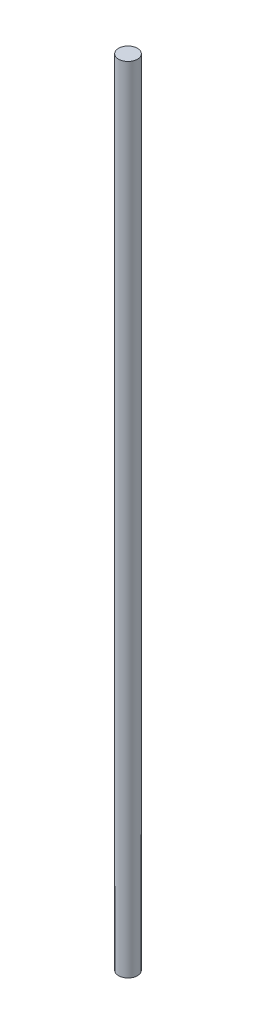
ISO-10303-21;
HEADER;
FILE_DESCRIPTION(('STEP AP214'),'2;1');
FILE_NAME('part.step','',(''),(''),'','','');
FILE_SCHEMA(('AUTOMOTIVE_DESIGN { 1 0 10303 214 1 1 1 1 }'));
ENDSEC;
DATA;
#1=APPLICATION_CONTEXT('core data for automotive mechanical design processes');
#2=APPLICATION_PROTOCOL_DEFINITION('international standard','automotive_design',2000,#1);
#3=PRODUCT_CONTEXT('',#1,'mechanical');
#4=PRODUCT('Part','Part','',(#3));
#5=PRODUCT_RELATED_PRODUCT_CATEGORY('part','',(#4));
#6=PRODUCT_DEFINITION_FORMATION('','',#4);
#7=PRODUCT_DEFINITION_CONTEXT('part definition',#1,'design');
#8=PRODUCT_DEFINITION('design','',#6,#7);
#9=PRODUCT_DEFINITION_SHAPE('','',#8);
#10=(LENGTH_UNIT() NAMED_UNIT(*) SI_UNIT(.MILLI.,.METRE.));
#11=(NAMED_UNIT(*) PLANE_ANGLE_UNIT() SI_UNIT($,.RADIAN.));
#12=(NAMED_UNIT(*) SI_UNIT($,.STERADIAN.) SOLID_ANGLE_UNIT());
#13=UNCERTAINTY_MEASURE_WITH_UNIT(LENGTH_MEASURE(1.E-05),#10,'distance_accuracy_value','');
#14=(GEOMETRIC_REPRESENTATION_CONTEXT(3) GLOBAL_UNCERTAINTY_ASSIGNED_CONTEXT((#13)) GLOBAL_UNIT_ASSIGNED_CONTEXT((#10,
#11,#12)) REPRESENTATION_CONTEXT('',''));
#15=CARTESIAN_POINT('',(0.,0.,0.));
#16=DIRECTION('',(0.,0.,1.));
#17=DIRECTION('',(1.,0.,0.));
#18=AXIS2_PLACEMENT_3D('',#15,#16,#17);
#19=CARTESIAN_POINT('',(0.,400.,0.));
#20=DIRECTION('',(0.,-1.,0.));
#21=DIRECTION('',(0.,0.,-1.));
#22=AXIS2_PLACEMENT_3D('',#19,#20,#21);
#23=CYLINDRICAL_SURFACE('',#22,4.7625);
#24=CARTESIAN_POINT('',(0.,400.,0.));
#25=DIRECTION('',(0.,1.,0.));
#26=DIRECTION('',(0.,0.,1.));
#27=AXIS2_PLACEMENT_3D('',#24,#25,#26);
#28=CIRCLE('',#27,4.7625);
#29=CARTESIAN_POINT('',(0.,400.,4.7625));
#30=VERTEX_POINT('',#29);
#31=EDGE_CURVE('E10',#30,#30,#28,.T.);
#32=ORIENTED_EDGE('',*,*,#31,.F.);
#33=EDGE_LOOP('',(#32));
#34=FACE_BOUND('',#33,.T.);
#35=CARTESIAN_POINT('',(0.,0.,0.));
#36=DIRECTION('',(0.,1.,0.));
#37=DIRECTION('',(0.,0.,1.));
#38=AXIS2_PLACEMENT_3D('',#35,#36,#37);
#39=CIRCLE('',#38,4.7625);
#40=CARTESIAN_POINT('',(0.,0.,4.7625));
#41=VERTEX_POINT('',#40);
#42=EDGE_CURVE('E37',#41,#41,#39,.T.);
#43=ORIENTED_EDGE('',*,*,#42,.T.);
#44=EDGE_LOOP('',(#43));
#45=FACE_BOUND('',#44,.T.);
#46=ADVANCED_FACE('F34',(#34,#45),#23,.T.);
#47=CARTESIAN_POINT('',(0.,400.,0.));
#48=DIRECTION('',(0.,1.,0.));
#49=DIRECTION('',(0.,0.,1.));
#50=AXIS2_PLACEMENT_3D('',#47,#48,#49);
#51=PLANE('',#50);
#52=ORIENTED_EDGE('',*,*,#31,.T.);
#53=EDGE_LOOP('',(#52));
#54=FACE_BOUND('',#53,.T.);
#55=ADVANCED_FACE('F50',(#54),#51,.T.);
#56=CARTESIAN_POINT('',(0.,0.,0.));
#57=DIRECTION('',(0.,1.,0.));
#58=DIRECTION('',(0.,0.,1.));
#59=AXIS2_PLACEMENT_3D('',#56,#57,#58);
#60=PLANE('',#59);
#61=ORIENTED_EDGE('',*,*,#42,.F.);
#62=EDGE_LOOP('',(#61));
#63=FACE_BOUND('',#62,.T.);
#64=ADVANCED_FACE('F48',(#63),#60,.F.);
#65=CLOSED_SHELL('',(#46,#55,#64));
#66=MANIFOLD_SOLID_BREP('B2',#65);
#67=ADVANCED_BREP_SHAPE_REPRESENTATION('',(#18,#66),#14);
#68=SHAPE_DEFINITION_REPRESENTATION(#9,#67);
ENDSEC;
END-ISO-10303-21;
